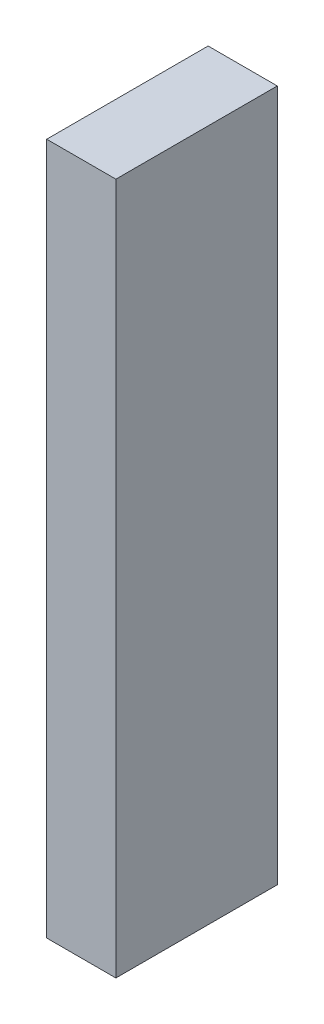
ISO-10303-21;
HEADER;
FILE_DESCRIPTION(('STEP AP214'),'2;1');
FILE_NAME('part.step','',(''),(''),'','','');
FILE_SCHEMA(('AUTOMOTIVE_DESIGN { 1 0 10303 214 1 1 1 1 }'));
ENDSEC;
DATA;
#1=APPLICATION_CONTEXT('core data for automotive mechanical design processes');
#2=APPLICATION_PROTOCOL_DEFINITION('international standard','automotive_design',2000,#1);
#3=PRODUCT_CONTEXT('',#1,'mechanical');
#4=PRODUCT('Part','Part','',(#3));
#5=PRODUCT_RELATED_PRODUCT_CATEGORY('part','',(#4));
#6=PRODUCT_DEFINITION_FORMATION('','',#4);
#7=PRODUCT_DEFINITION_CONTEXT('part definition',#1,'design');
#8=PRODUCT_DEFINITION('design','',#6,#7);
#9=PRODUCT_DEFINITION_SHAPE('','',#8);
#10=(LENGTH_UNIT() NAMED_UNIT(*) SI_UNIT(.MILLI.,.METRE.));
#11=(NAMED_UNIT(*) PLANE_ANGLE_UNIT() SI_UNIT($,.RADIAN.));
#12=(NAMED_UNIT(*) SI_UNIT($,.STERADIAN.) SOLID_ANGLE_UNIT());
#13=UNCERTAINTY_MEASURE_WITH_UNIT(LENGTH_MEASURE(1.E-05),#10,'distance_accuracy_value','');
#14=(GEOMETRIC_REPRESENTATION_CONTEXT(3) GLOBAL_UNCERTAINTY_ASSIGNED_CONTEXT((#13)) GLOBAL_UNIT_ASSIGNED_CONTEXT((#10,
#11,#12)) REPRESENTATION_CONTEXT('',''));
#15=CARTESIAN_POINT('',(0.,0.,0.));
#16=DIRECTION('',(0.,0.,1.));
#17=DIRECTION('',(1.,0.,0.));
#18=AXIS2_PLACEMENT_3D('',#15,#16,#17);
#19=CARTESIAN_POINT('',(0.,30.,23.1080145322621));
#20=DIRECTION('',(0.,0.,1.));
#21=DIRECTION('',(1.,0.,0.));
#22=AXIS2_PLACEMENT_3D('',#19,#20,#21);
#23=PLANE('',#22);
#24=DIRECTION('',(-1.,0.,0.));
#25=VECTOR('',#24,1.);
#26=CARTESIAN_POINT('',(0.,0.,23.1080145322621));
#27=LINE('',#26,#25);
#28=CARTESIAN_POINT('',(-22.5068736779572,0.,23.1080145322621));
#29=VERTEX_POINT('',#28);
#30=CARTESIAN_POINT('',(-25.5068736779572,0.,23.1080145322621));
#31=VERTEX_POINT('',#30);
#32=EDGE_CURVE('E98',#29,#31,#27,.T.);
#33=ORIENTED_EDGE('',*,*,#32,.T.);
#34=DIRECTION('',(0.,-1.,0.));
#35=VECTOR('',#34,1.);
#36=CARTESIAN_POINT('',(-25.5068736779572,30.,23.1080145322621));
#37=LINE('',#36,#35);
#38=CARTESIAN_POINT('',(-25.5068736779572,30.,23.1080145322621));
#39=VERTEX_POINT('',#38);
#40=EDGE_CURVE('E11',#39,#31,#37,.T.);
#41=ORIENTED_EDGE('',*,*,#40,.F.);
#42=DIRECTION('',(-1.,0.,0.));
#43=VECTOR('',#42,1.);
#44=CARTESIAN_POINT('',(0.,30.,23.1080145322621));
#45=LINE('',#44,#43);
#46=CARTESIAN_POINT('',(-22.5068736779572,30.,23.1080145322621));
#47=VERTEX_POINT('',#46);
#48=EDGE_CURVE('E84',#47,#39,#45,.T.);
#49=ORIENTED_EDGE('',*,*,#48,.F.);
#50=DIRECTION('',(0.,-1.,0.));
#51=VECTOR('',#50,1.);
#52=CARTESIAN_POINT('',(-22.5068736779572,30.,23.1080145322621));
#53=LINE('',#52,#51);
#54=EDGE_CURVE('E51',#47,#29,#53,.T.);
#55=ORIENTED_EDGE('',*,*,#54,.T.);
#56=EDGE_LOOP('',(#33,#41,#49,#55));
#57=FACE_BOUND('',#56,.T.);
#58=ADVANCED_FACE('F35',(#57),#23,.F.);
#59=CARTESIAN_POINT('',(-25.5068736779572,30.,0.));
#60=DIRECTION('',(1.,0.,0.));
#61=DIRECTION('',(0.,0.,-1.));
#62=AXIS2_PLACEMENT_3D('',#59,#60,#61);
#63=PLANE('',#62);
#64=DIRECTION('',(0.,0.,1.));
#65=VECTOR('',#64,1.);
#66=CARTESIAN_POINT('',(-25.5068736779572,0.,0.));
#67=LINE('',#66,#65);
#68=CARTESIAN_POINT('',(-25.5068736779572,0.,30.1080145322621));
#69=VERTEX_POINT('',#68);
#70=EDGE_CURVE('E89',#31,#69,#67,.T.);
#71=ORIENTED_EDGE('',*,*,#70,.T.);
#72=DIRECTION('',(0.,-1.,0.));
#73=VECTOR('',#72,1.);
#74=CARTESIAN_POINT('',(-25.5068736779572,30.,30.1080145322621));
#75=LINE('',#74,#73);
#76=CARTESIAN_POINT('',(-25.5068736779572,30.,30.1080145322621));
#77=VERTEX_POINT('',#76);
#78=EDGE_CURVE('E43',#77,#69,#75,.T.);
#79=ORIENTED_EDGE('',*,*,#78,.F.);
#80=DIRECTION('',(0.,0.,1.));
#81=VECTOR('',#80,1.);
#82=CARTESIAN_POINT('',(-25.5068736779572,30.,0.));
#83=LINE('',#82,#81);
#84=EDGE_CURVE('E76',#39,#77,#83,.T.);
#85=ORIENTED_EDGE('',*,*,#84,.F.);
#86=ORIENTED_EDGE('',*,*,#40,.T.);
#87=EDGE_LOOP('',(#71,#79,#85,#86));
#88=FACE_BOUND('',#87,.T.);
#89=ADVANCED_FACE('F88',(#88),#63,.F.);
#90=CARTESIAN_POINT('',(0.,30.,30.1080145322621));
#91=DIRECTION('',(0.,0.,1.));
#92=DIRECTION('',(1.,0.,0.));
#93=AXIS2_PLACEMENT_3D('',#90,#91,#92);
#94=PLANE('',#93);
#95=DIRECTION('',(-1.,0.,0.));
#96=VECTOR('',#95,1.);
#97=CARTESIAN_POINT('',(0.,0.,30.1080145322621));
#98=LINE('',#97,#96);
#99=CARTESIAN_POINT('',(-22.5068736779572,0.,30.1080145322621));
#100=VERTEX_POINT('',#99);
#101=EDGE_CURVE('E101',#100,#69,#98,.T.);
#102=ORIENTED_EDGE('',*,*,#101,.F.);
#103=DIRECTION('',(0.,-1.,0.));
#104=VECTOR('',#103,1.);
#105=CARTESIAN_POINT('',(-22.5068736779572,30.,30.1080145322621));
#106=LINE('',#105,#104);
#107=CARTESIAN_POINT('',(-22.5068736779572,30.,30.1080145322621));
#108=VERTEX_POINT('',#107);
#109=EDGE_CURVE('E65',#108,#100,#106,.T.);
#110=ORIENTED_EDGE('',*,*,#109,.F.);
#111=DIRECTION('',(-1.,0.,0.));
#112=VECTOR('',#111,1.);
#113=CARTESIAN_POINT('',(0.,30.,30.1080145322621));
#114=LINE('',#113,#112);
#115=EDGE_CURVE('E83',#108,#77,#114,.T.);
#116=ORIENTED_EDGE('',*,*,#115,.T.);
#117=ORIENTED_EDGE('',*,*,#78,.T.);
#118=EDGE_LOOP('',(#102,#110,#116,#117));
#119=FACE_BOUND('',#118,.T.);
#120=ADVANCED_FACE('F92',(#119),#94,.T.);
#121=CARTESIAN_POINT('',(-22.5068736779572,30.,0.));
#122=DIRECTION('',(1.,0.,0.));
#123=DIRECTION('',(0.,0.,-1.));
#124=AXIS2_PLACEMENT_3D('',#121,#122,#123);
#125=PLANE('',#124);
#126=DIRECTION('',(0.,0.,1.));
#127=VECTOR('',#126,1.);
#128=CARTESIAN_POINT('',(-22.5068736779572,0.,0.));
#129=LINE('',#128,#127);
#130=EDGE_CURVE('E103',#29,#100,#129,.T.);
#131=ORIENTED_EDGE('',*,*,#130,.F.);
#132=ORIENTED_EDGE('',*,*,#54,.F.);
#133=DIRECTION('',(0.,0.,1.));
#134=VECTOR('',#133,1.);
#135=CARTESIAN_POINT('',(-22.5068736779572,30.,0.));
#136=LINE('',#135,#134);
#137=EDGE_CURVE('E93',#47,#108,#136,.T.);
#138=ORIENTED_EDGE('',*,*,#137,.T.);
#139=ORIENTED_EDGE('',*,*,#109,.T.);
#140=EDGE_LOOP('',(#131,#132,#138,#139));
#141=FACE_BOUND('',#140,.T.);
#142=ADVANCED_FACE('F109',(#141),#125,.T.);
#143=CARTESIAN_POINT('',(0.,30.,0.));
#144=DIRECTION('',(0.,1.,0.));
#145=DIRECTION('',(0.,0.,1.));
#146=AXIS2_PLACEMENT_3D('',#143,#144,#145);
#147=PLANE('',#146);
#148=ORIENTED_EDGE('',*,*,#48,.T.);
#149=ORIENTED_EDGE('',*,*,#84,.T.);
#150=ORIENTED_EDGE('',*,*,#115,.F.);
#151=ORIENTED_EDGE('',*,*,#137,.F.);
#152=EDGE_LOOP('',(#148,#149,#150,#151));
#153=FACE_BOUND('',#152,.T.);
#154=ADVANCED_FACE('F80',(#153),#147,.T.);
#155=CARTESIAN_POINT('',(0.,0.,0.));
#156=DIRECTION('',(0.,1.,0.));
#157=DIRECTION('',(0.,0.,1.));
#158=AXIS2_PLACEMENT_3D('',#155,#156,#157);
#159=PLANE('',#158);
#160=ORIENTED_EDGE('',*,*,#32,.F.);
#161=ORIENTED_EDGE('',*,*,#130,.T.);
#162=ORIENTED_EDGE('',*,*,#101,.T.);
#163=ORIENTED_EDGE('',*,*,#70,.F.);
#164=EDGE_LOOP('',(#160,#161,#162,#163));
#165=FACE_BOUND('',#164,.T.);
#166=ADVANCED_FACE('F108',(#165),#159,.F.);
#167=CLOSED_SHELL('',(#58,#89,#120,#142,#154,#166));
#168=MANIFOLD_SOLID_BREP('B2',#167);
#169=ADVANCED_BREP_SHAPE_REPRESENTATION('',(#18,#168),#14);
#170=SHAPE_DEFINITION_REPRESENTATION(#9,#169);
ENDSEC;
END-ISO-10303-21;
